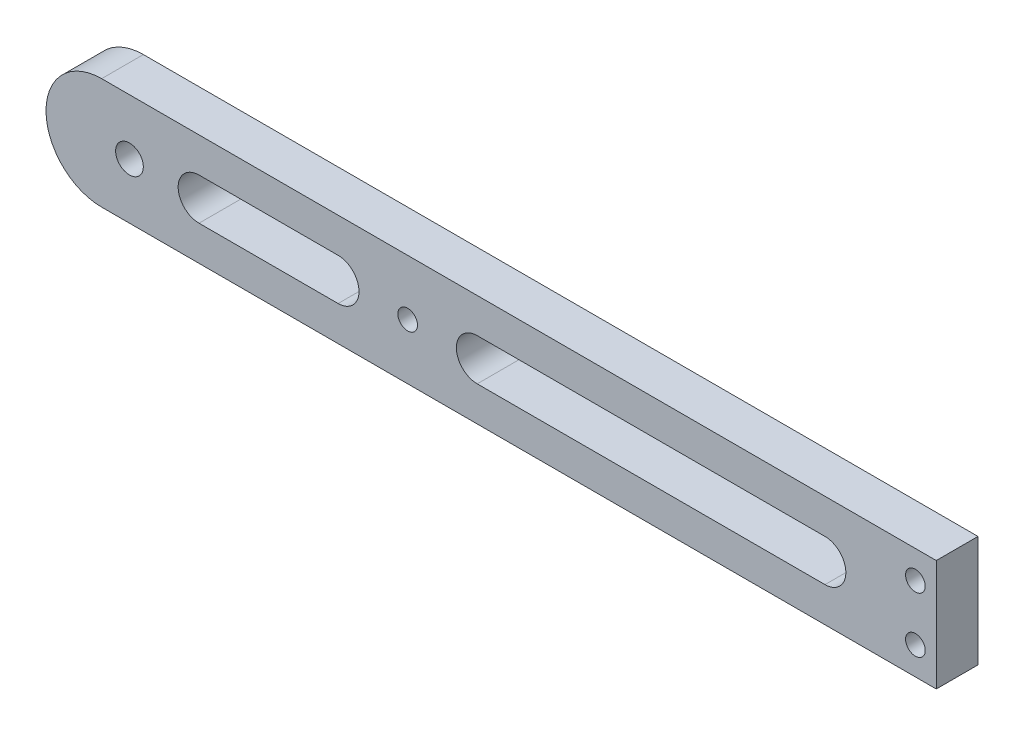
ISO-10303-21;
HEADER;
FILE_DESCRIPTION(('STEP AP214'),'2;1');
FILE_NAME('part.step','',(''),(''),'','','');
FILE_SCHEMA(('AUTOMOTIVE_DESIGN { 1 0 10303 214 1 1 1 1 }'));
ENDSEC;
DATA;
#1=APPLICATION_CONTEXT('core data for automotive mechanical design processes');
#2=APPLICATION_PROTOCOL_DEFINITION('international standard','automotive_design',2000,#1);
#3=PRODUCT_CONTEXT('',#1,'mechanical');
#4=PRODUCT('Part','Part','',(#3));
#5=PRODUCT_RELATED_PRODUCT_CATEGORY('part','',(#4));
#6=PRODUCT_DEFINITION_FORMATION('','',#4);
#7=PRODUCT_DEFINITION_CONTEXT('part definition',#1,'design');
#8=PRODUCT_DEFINITION('design','',#6,#7);
#9=PRODUCT_DEFINITION_SHAPE('','',#8);
#10=(LENGTH_UNIT() NAMED_UNIT(*) SI_UNIT(.MILLI.,.METRE.));
#11=(NAMED_UNIT(*) PLANE_ANGLE_UNIT() SI_UNIT($,.RADIAN.));
#12=(NAMED_UNIT(*) SI_UNIT($,.STERADIAN.) SOLID_ANGLE_UNIT());
#13=UNCERTAINTY_MEASURE_WITH_UNIT(LENGTH_MEASURE(1.E-05),#10,'distance_accuracy_value','');
#14=(GEOMETRIC_REPRESENTATION_CONTEXT(3) GLOBAL_UNCERTAINTY_ASSIGNED_CONTEXT((#13)) GLOBAL_UNIT_ASSIGNED_CONTEXT((#10,
#11,#12)) REPRESENTATION_CONTEXT('',''));
#15=CARTESIAN_POINT('',(0.,0.,0.));
#16=DIRECTION('',(0.,0.,1.));
#17=DIRECTION('',(1.,0.,0.));
#18=AXIS2_PLACEMENT_3D('',#15,#16,#17);
#19=CARTESIAN_POINT('',(0.,0.,9.525));
#20=DIRECTION('',(0.,0.,1.));
#21=DIRECTION('',(1.,0.,0.));
#22=AXIS2_PLACEMENT_3D('',#19,#20,#21);
#23=PLANE('',#22);
#24=CARTESIAN_POINT('',(-136.525,12.7,9.525));
#25=DIRECTION('',(0.,0.,-1.));
#26=DIRECTION('',(-1.,0.,0.));
#27=AXIS2_PLACEMENT_3D('',#24,#25,#26);
#28=CIRCLE('',#27,4.7625);
#29=CARTESIAN_POINT('',(-136.525,17.4625,9.525));
#30=VERTEX_POINT('',#29);
#31=CARTESIAN_POINT('',(-136.525,7.9375,9.525));
#32=VERTEX_POINT('',#31);
#33=EDGE_CURVE('E140',#30,#32,#28,.T.);
#34=ORIENTED_EDGE('',*,*,#33,.T.);
#35=DIRECTION('',(-1.,0.,0.));
#36=VECTOR('',#35,1.);
#37=CARTESIAN_POINT('',(-136.525,7.9375,9.525));
#38=LINE('',#37,#36);
#39=CARTESIAN_POINT('',(-168.275,7.9375,9.525));
#40=VERTEX_POINT('',#39);
#41=EDGE_CURVE('E149',#32,#40,#38,.T.);
#42=ORIENTED_EDGE('',*,*,#41,.T.);
#43=CARTESIAN_POINT('',(-168.275,12.7,9.525));
#44=DIRECTION('',(0.,0.,-1.));
#45=DIRECTION('',(-1.,0.,0.));
#46=AXIS2_PLACEMENT_3D('',#43,#44,#45);
#47=CIRCLE('',#46,4.7625);
#48=CARTESIAN_POINT('',(-168.275,17.4625,9.525));
#49=VERTEX_POINT('',#48);
#50=EDGE_CURVE('E64',#40,#49,#47,.T.);
#51=ORIENTED_EDGE('',*,*,#50,.T.);
#52=DIRECTION('',(1.,0.,0.));
#53=VECTOR('',#52,1.);
#54=CARTESIAN_POINT('',(-136.525,17.4625,9.525));
#55=LINE('',#54,#53);
#56=EDGE_CURVE('E146',#49,#30,#55,.T.);
#57=ORIENTED_EDGE('',*,*,#56,.T.);
#58=EDGE_LOOP('',(#34,#42,#51,#57));
#59=FACE_BOUND('',#58,.T.);
#60=CARTESIAN_POINT('',(-25.4,12.7,9.525));
#61=DIRECTION('',(0.,0.,-1.));
#62=DIRECTION('',(-1.,0.,0.));
#63=AXIS2_PLACEMENT_3D('',#60,#61,#62);
#64=CIRCLE('',#63,4.7625);
#65=CARTESIAN_POINT('',(-25.4,17.4625,9.525));
#66=VERTEX_POINT('',#65);
#67=CARTESIAN_POINT('',(-25.4,7.9375,9.525));
#68=VERTEX_POINT('',#67);
#69=EDGE_CURVE('E174',#66,#68,#64,.T.);
#70=ORIENTED_EDGE('',*,*,#69,.T.);
#71=DIRECTION('',(-1.,0.,0.));
#72=VECTOR('',#71,1.);
#73=CARTESIAN_POINT('',(-25.4,7.9375,9.525));
#74=LINE('',#73,#72);
#75=CARTESIAN_POINT('',(-104.775,7.9375,9.525));
#76=VERTEX_POINT('',#75);
#77=EDGE_CURVE('E177',#68,#76,#74,.T.);
#78=ORIENTED_EDGE('',*,*,#77,.T.);
#79=CARTESIAN_POINT('',(-104.775,12.7,9.525));
#80=DIRECTION('',(0.,0.,-1.));
#81=DIRECTION('',(-1.,0.,0.));
#82=AXIS2_PLACEMENT_3D('',#79,#80,#81);
#83=CIRCLE('',#82,4.7625);
#84=CARTESIAN_POINT('',(-104.775,17.4625,9.525));
#85=VERTEX_POINT('',#84);
#86=EDGE_CURVE('E181',#76,#85,#83,.T.);
#87=ORIENTED_EDGE('',*,*,#86,.T.);
#88=DIRECTION('',(1.,0.,0.));
#89=VECTOR('',#88,1.);
#90=CARTESIAN_POINT('',(-25.4,17.4625,9.525));
#91=LINE('',#90,#89);
#92=EDGE_CURVE('E184',#85,#66,#91,.T.);
#93=ORIENTED_EDGE('',*,*,#92,.T.);
#94=EDGE_LOOP('',(#70,#78,#87,#93));
#95=FACE_BOUND('',#94,.T.);
#96=CARTESIAN_POINT('',(-120.65,12.7,9.525));
#97=DIRECTION('',(0.,0.,1.));
#98=DIRECTION('',(1.,0.,0.));
#99=AXIS2_PLACEMENT_3D('',#96,#97,#98);
#100=CIRCLE('',#99,2.2479);
#101=CARTESIAN_POINT('',(-118.4021,12.7,9.525));
#102=VERTEX_POINT('',#101);
#103=EDGE_CURVE('E216',#102,#102,#100,.T.);
#104=ORIENTED_EDGE('',*,*,#103,.F.);
#105=EDGE_LOOP('',(#104));
#106=FACE_BOUND('',#105,.T.);
#107=CARTESIAN_POINT('',(-184.15,12.7,9.525));
#108=DIRECTION('',(0.,0.,1.));
#109=DIRECTION('',(1.,0.,0.));
#110=AXIS2_PLACEMENT_3D('',#107,#108,#109);
#111=CIRCLE('',#110,3.1623);
#112=CARTESIAN_POINT('',(-180.9877,12.7,9.525));
#113=VERTEX_POINT('',#112);
#114=EDGE_CURVE('E222',#113,#113,#111,.T.);
#115=ORIENTED_EDGE('',*,*,#114,.F.);
#116=EDGE_LOOP('',(#115));
#117=FACE_BOUND('',#116,.T.);
#118=CARTESIAN_POINT('',(-4.7625,6.34999999999999,9.525));
#119=DIRECTION('',(0.,0.,1.));
#120=DIRECTION('',(1.,0.,0.));
#121=AXIS2_PLACEMENT_3D('',#118,#119,#120);
#122=CIRCLE('',#121,2.24789999999999);
#123=CARTESIAN_POINT('',(-2.51460000000001,6.34999999999999,9.525));
#124=VERTEX_POINT('',#123);
#125=EDGE_CURVE('E226',#124,#124,#122,.T.);
#126=ORIENTED_EDGE('',*,*,#125,.F.);
#127=EDGE_LOOP('',(#126));
#128=FACE_BOUND('',#127,.T.);
#129=CARTESIAN_POINT('',(-4.7625,19.05,9.525));
#130=DIRECTION('',(0.,0.,1.));
#131=DIRECTION('',(1.,0.,0.));
#132=AXIS2_PLACEMENT_3D('',#129,#130,#131);
#133=CIRCLE('',#132,2.24789999999999);
#134=CARTESIAN_POINT('',(-2.51460000000001,19.05,9.525));
#135=VERTEX_POINT('',#134);
#136=EDGE_CURVE('E231',#135,#135,#133,.T.);
#137=ORIENTED_EDGE('',*,*,#136,.F.);
#138=EDGE_LOOP('',(#137));
#139=FACE_BOUND('',#138,.T.);
#140=CARTESIAN_POINT('',(-190.5,12.7,9.525));
#141=DIRECTION('',(0.,0.,1.));
#142=DIRECTION('',(1.,0.,0.));
#143=AXIS2_PLACEMENT_3D('',#140,#141,#142);
#144=CIRCLE('',#143,12.7);
#145=CARTESIAN_POINT('',(-190.5,0.,9.525));
#146=VERTEX_POINT('',#145);
#147=CARTESIAN_POINT('',(-190.5,25.4,9.525));
#148=VERTEX_POINT('',#147);
#149=EDGE_CURVE('E208',#146,#148,#144,.F.);
#150=ORIENTED_EDGE('',*,*,#149,.F.);
#151=DIRECTION('',(1.,0.,0.));
#152=VECTOR('',#151,1.);
#153=CARTESIAN_POINT('',(0.,0.,9.525));
#154=LINE('',#153,#152);
#155=CARTESIAN_POINT('',(0.,0.,9.525));
#156=VERTEX_POINT('',#155);
#157=EDGE_CURVE('E245',#146,#156,#154,.T.);
#158=ORIENTED_EDGE('',*,*,#157,.T.);
#159=DIRECTION('',(0.,1.,0.));
#160=VECTOR('',#159,1.);
#161=CARTESIAN_POINT('',(0.,0.,9.525));
#162=LINE('',#161,#160);
#163=CARTESIAN_POINT('',(0.,25.4,9.525));
#164=VERTEX_POINT('',#163);
#165=EDGE_CURVE('E238',#156,#164,#162,.T.);
#166=ORIENTED_EDGE('',*,*,#165,.T.);
#167=DIRECTION('',(-1.,0.,0.));
#168=VECTOR('',#167,1.);
#169=CARTESIAN_POINT('',(0.,25.4,9.525));
#170=LINE('',#169,#168);
#171=EDGE_CURVE('E241',#164,#148,#170,.T.);
#172=ORIENTED_EDGE('',*,*,#171,.T.);
#173=EDGE_LOOP('',(#150,#158,#166,#172));
#174=FACE_BOUND('',#173,.T.);
#175=ADVANCED_FACE('F48',(#59,#95,#106,#117,#128,#139,#174),#23,.T.);
#176=CARTESIAN_POINT('',(0.,0.,0.));
#177=DIRECTION('',(0.,0.,1.));
#178=DIRECTION('',(1.,0.,0.));
#179=AXIS2_PLACEMENT_3D('',#176,#177,#178);
#180=PLANE('',#179);
#181=DIRECTION('',(-1.,0.,0.));
#182=VECTOR('',#181,1.);
#183=CARTESIAN_POINT('',(-136.525,7.9375,0.));
#184=LINE('',#183,#182);
#185=CARTESIAN_POINT('',(-136.525,7.9375,0.));
#186=VERTEX_POINT('',#185);
#187=CARTESIAN_POINT('',(-168.275,7.9375,0.));
#188=VERTEX_POINT('',#187);
#189=EDGE_CURVE('E164',#186,#188,#184,.T.);
#190=ORIENTED_EDGE('',*,*,#189,.F.);
#191=CARTESIAN_POINT('',(-136.525,12.7,0.));
#192=DIRECTION('',(0.,0.,-1.));
#193=DIRECTION('',(-1.,0.,0.));
#194=AXIS2_PLACEMENT_3D('',#191,#192,#193);
#195=CIRCLE('',#194,4.7625);
#196=CARTESIAN_POINT('',(-136.525,17.4625,0.));
#197=VERTEX_POINT('',#196);
#198=EDGE_CURVE('E72',#197,#186,#195,.T.);
#199=ORIENTED_EDGE('',*,*,#198,.F.);
#200=DIRECTION('',(1.,0.,0.));
#201=VECTOR('',#200,1.);
#202=CARTESIAN_POINT('',(-136.525,17.4625,0.));
#203=LINE('',#202,#201);
#204=CARTESIAN_POINT('',(-168.275,17.4625,0.));
#205=VERTEX_POINT('',#204);
#206=EDGE_CURVE('E155',#205,#197,#203,.T.);
#207=ORIENTED_EDGE('',*,*,#206,.F.);
#208=CARTESIAN_POINT('',(-168.275,12.7,0.));
#209=DIRECTION('',(0.,0.,-1.));
#210=DIRECTION('',(-1.,0.,0.));
#211=AXIS2_PLACEMENT_3D('',#208,#209,#210);
#212=CIRCLE('',#211,4.7625);
#213=EDGE_CURVE('E158',#188,#205,#212,.T.);
#214=ORIENTED_EDGE('',*,*,#213,.F.);
#215=EDGE_LOOP('',(#190,#199,#207,#214));
#216=FACE_BOUND('',#215,.T.);
#217=DIRECTION('',(-1.,0.,0.));
#218=VECTOR('',#217,1.);
#219=CARTESIAN_POINT('',(-25.4,7.9375,0.));
#220=LINE('',#219,#218);
#221=CARTESIAN_POINT('',(-25.4,7.9375,0.));
#222=VERTEX_POINT('',#221);
#223=CARTESIAN_POINT('',(-104.775,7.9375,0.));
#224=VERTEX_POINT('',#223);
#225=EDGE_CURVE('E189',#222,#224,#220,.T.);
#226=ORIENTED_EDGE('',*,*,#225,.F.);
#227=CARTESIAN_POINT('',(-25.4,12.7,0.));
#228=DIRECTION('',(0.,0.,-1.));
#229=DIRECTION('',(-1.,0.,0.));
#230=AXIS2_PLACEMENT_3D('',#227,#228,#229);
#231=CIRCLE('',#230,4.7625);
#232=CARTESIAN_POINT('',(-25.4,17.4625,0.));
#233=VERTEX_POINT('',#232);
#234=EDGE_CURVE('E170',#233,#222,#231,.T.);
#235=ORIENTED_EDGE('',*,*,#234,.F.);
#236=DIRECTION('',(1.,0.,0.));
#237=VECTOR('',#236,1.);
#238=CARTESIAN_POINT('',(-25.4,17.4625,0.));
#239=LINE('',#238,#237);
#240=CARTESIAN_POINT('',(-104.775,17.4625,0.));
#241=VERTEX_POINT('',#240);
#242=EDGE_CURVE('E178',#241,#233,#239,.T.);
#243=ORIENTED_EDGE('',*,*,#242,.F.);
#244=CARTESIAN_POINT('',(-104.775,12.7,0.));
#245=DIRECTION('',(0.,0.,-1.));
#246=DIRECTION('',(-1.,0.,0.));
#247=AXIS2_PLACEMENT_3D('',#244,#245,#246);
#248=CIRCLE('',#247,4.7625);
#249=EDGE_CURVE('E192',#224,#241,#248,.T.);
#250=ORIENTED_EDGE('',*,*,#249,.F.);
#251=EDGE_LOOP('',(#226,#235,#243,#250));
#252=FACE_BOUND('',#251,.T.);
#253=CARTESIAN_POINT('',(-120.65,12.7,0.));
#254=DIRECTION('',(0.,0.,1.));
#255=DIRECTION('',(1.,0.,0.));
#256=AXIS2_PLACEMENT_3D('',#253,#254,#255);
#257=CIRCLE('',#256,2.2479);
#258=CARTESIAN_POINT('',(-118.4021,12.7,0.));
#259=VERTEX_POINT('',#258);
#260=EDGE_CURVE('E219',#259,#259,#257,.T.);
#261=ORIENTED_EDGE('',*,*,#260,.T.);
#262=EDGE_LOOP('',(#261));
#263=FACE_BOUND('',#262,.T.);
#264=CARTESIAN_POINT('',(-184.15,12.7,0.));
#265=DIRECTION('',(0.,0.,1.));
#266=DIRECTION('',(1.,0.,0.));
#267=AXIS2_PLACEMENT_3D('',#264,#265,#266);
#268=CIRCLE('',#267,3.1623);
#269=CARTESIAN_POINT('',(-180.9877,12.7,0.));
#270=VERTEX_POINT('',#269);
#271=EDGE_CURVE('E223',#270,#270,#268,.T.);
#272=ORIENTED_EDGE('',*,*,#271,.T.);
#273=EDGE_LOOP('',(#272));
#274=FACE_BOUND('',#273,.T.);
#275=CARTESIAN_POINT('',(-4.7625,6.34999999999999,0.));
#276=DIRECTION('',(0.,0.,1.));
#277=DIRECTION('',(1.,0.,0.));
#278=AXIS2_PLACEMENT_3D('',#275,#276,#277);
#279=CIRCLE('',#278,2.24789999999999);
#280=CARTESIAN_POINT('',(-2.51460000000001,6.34999999999999,0.));
#281=VERTEX_POINT('',#280);
#282=EDGE_CURVE('E52',#281,#281,#279,.T.);
#283=ORIENTED_EDGE('',*,*,#282,.T.);
#284=EDGE_LOOP('',(#283));
#285=FACE_BOUND('',#284,.T.);
#286=CARTESIAN_POINT('',(-4.7625,19.05,0.));
#287=DIRECTION('',(0.,0.,1.));
#288=DIRECTION('',(1.,0.,0.));
#289=AXIS2_PLACEMENT_3D('',#286,#287,#288);
#290=CIRCLE('',#289,2.24789999999999);
#291=CARTESIAN_POINT('',(-2.51460000000001,19.05,0.));
#292=VERTEX_POINT('',#291);
#293=EDGE_CURVE('E234',#292,#292,#290,.T.);
#294=ORIENTED_EDGE('',*,*,#293,.T.);
#295=EDGE_LOOP('',(#294));
#296=FACE_BOUND('',#295,.T.);
#297=DIRECTION('',(1.,0.,0.));
#298=VECTOR('',#297,1.);
#299=CARTESIAN_POINT('',(0.,0.,0.));
#300=LINE('',#299,#298);
#301=CARTESIAN_POINT('',(-190.5,0.,0.));
#302=VERTEX_POINT('',#301);
#303=CARTESIAN_POINT('',(0.,0.,0.));
#304=VERTEX_POINT('',#303);
#305=EDGE_CURVE('E242',#302,#304,#300,.T.);
#306=ORIENTED_EDGE('',*,*,#305,.F.);
#307=CARTESIAN_POINT('',(-190.5,12.7,0.));
#308=DIRECTION('',(0.,0.,1.));
#309=DIRECTION('',(1.,0.,0.));
#310=AXIS2_PLACEMENT_3D('',#307,#308,#309);
#311=CIRCLE('',#310,12.7);
#312=CARTESIAN_POINT('',(-190.5,25.4,0.));
#313=VERTEX_POINT('',#312);
#314=EDGE_CURVE('E209',#302,#313,#311,.F.);
#315=ORIENTED_EDGE('',*,*,#314,.T.);
#316=DIRECTION('',(-1.,0.,0.));
#317=VECTOR('',#316,1.);
#318=CARTESIAN_POINT('',(0.,25.4,0.));
#319=LINE('',#318,#317);
#320=CARTESIAN_POINT('',(0.,25.4,0.));
#321=VERTEX_POINT('',#320);
#322=EDGE_CURVE('E249',#321,#313,#319,.T.);
#323=ORIENTED_EDGE('',*,*,#322,.F.);
#324=DIRECTION('',(0.,1.,0.));
#325=VECTOR('',#324,1.);
#326=CARTESIAN_POINT('',(0.,0.,0.));
#327=LINE('',#326,#325);
#328=EDGE_CURVE('E237',#304,#321,#327,.T.);
#329=ORIENTED_EDGE('',*,*,#328,.F.);
#330=EDGE_LOOP('',(#306,#315,#323,#329));
#331=FACE_BOUND('',#330,.T.);
#332=ADVANCED_FACE('F263',(#216,#252,#263,#274,#285,#296,#331),#180,.F.);
#333=CARTESIAN_POINT('',(0.,25.4,9.525));
#334=DIRECTION('',(0.,-1.,0.));
#335=DIRECTION('',(1.,0.,0.));
#336=AXIS2_PLACEMENT_3D('',#333,#334,#335);
#337=PLANE('',#336);
#338=DIRECTION('',(0.,0.,1.));
#339=VECTOR('',#338,1.);
#340=CARTESIAN_POINT('',(-190.5,25.4,0.));
#341=LINE('',#340,#339);
#342=EDGE_CURVE('E212',#313,#148,#341,.T.);
#343=ORIENTED_EDGE('',*,*,#342,.T.);
#344=ORIENTED_EDGE('',*,*,#171,.F.);
#345=DIRECTION('',(0.,0.,-1.));
#346=VECTOR('',#345,1.);
#347=CARTESIAN_POINT('',(0.,25.4,9.525));
#348=LINE('',#347,#346);
#349=EDGE_CURVE('E13',#164,#321,#348,.T.);
#350=ORIENTED_EDGE('',*,*,#349,.T.);
#351=ORIENTED_EDGE('',*,*,#322,.T.);
#352=EDGE_LOOP('',(#343,#344,#350,#351));
#353=FACE_BOUND('',#352,.T.);
#354=ADVANCED_FACE('F265',(#353),#337,.F.);
#355=CARTESIAN_POINT('',(0.,0.,9.525));
#356=DIRECTION('',(-1.,0.,0.));
#357=DIRECTION('',(0.,0.,1.));
#358=AXIS2_PLACEMENT_3D('',#355,#356,#357);
#359=PLANE('',#358);
#360=ORIENTED_EDGE('',*,*,#328,.T.);
#361=ORIENTED_EDGE('',*,*,#349,.F.);
#362=ORIENTED_EDGE('',*,*,#165,.F.);
#363=DIRECTION('',(0.,0.,-1.));
#364=VECTOR('',#363,1.);
#365=CARTESIAN_POINT('',(0.,0.,9.525));
#366=LINE('',#365,#364);
#367=EDGE_CURVE('E57',#156,#304,#366,.T.);
#368=ORIENTED_EDGE('',*,*,#367,.T.);
#369=EDGE_LOOP('',(#360,#361,#362,#368));
#370=FACE_BOUND('',#369,.T.);
#371=ADVANCED_FACE('F50',(#370),#359,.F.);
#372=CARTESIAN_POINT('',(0.,0.,9.525));
#373=DIRECTION('',(0.,1.,0.));
#374=DIRECTION('',(-1.,0.,0.));
#375=AXIS2_PLACEMENT_3D('',#372,#373,#374);
#376=PLANE('',#375);
#377=ORIENTED_EDGE('',*,*,#157,.F.);
#378=DIRECTION('',(0.,0.,1.));
#379=VECTOR('',#378,1.);
#380=CARTESIAN_POINT('',(-190.5,0.,0.));
#381=LINE('',#380,#379);
#382=EDGE_CURVE('E199',#302,#146,#381,.T.);
#383=ORIENTED_EDGE('',*,*,#382,.F.);
#384=ORIENTED_EDGE('',*,*,#305,.T.);
#385=ORIENTED_EDGE('',*,*,#367,.F.);
#386=EDGE_LOOP('',(#377,#383,#384,#385));
#387=FACE_BOUND('',#386,.T.);
#388=ADVANCED_FACE('F268',(#387),#376,.F.);
#389=CARTESIAN_POINT('',(-4.7625,19.05,9.525));
#390=DIRECTION('',(0.,0.,1.));
#391=DIRECTION('',(1.,0.,0.));
#392=AXIS2_PLACEMENT_3D('',#389,#390,#391);
#393=CYLINDRICAL_SURFACE('',#392,2.24789999999999);
#394=ORIENTED_EDGE('',*,*,#136,.T.);
#395=EDGE_LOOP('',(#394));
#396=FACE_BOUND('',#395,.T.);
#397=ORIENTED_EDGE('',*,*,#293,.F.);
#398=EDGE_LOOP('',(#397));
#399=FACE_BOUND('',#398,.T.);
#400=ADVANCED_FACE('F293',(#396,#399),#393,.F.);
#401=CARTESIAN_POINT('',(-4.7625,6.34999999999999,9.525));
#402=DIRECTION('',(0.,0.,1.));
#403=DIRECTION('',(1.,0.,0.));
#404=AXIS2_PLACEMENT_3D('',#401,#402,#403);
#405=CYLINDRICAL_SURFACE('',#404,2.24789999999999);
#406=ORIENTED_EDGE('',*,*,#125,.T.);
#407=EDGE_LOOP('',(#406));
#408=FACE_BOUND('',#407,.T.);
#409=ORIENTED_EDGE('',*,*,#282,.F.);
#410=EDGE_LOOP('',(#409));
#411=FACE_BOUND('',#410,.T.);
#412=ADVANCED_FACE('F313',(#408,#411),#405,.F.);
#413=CARTESIAN_POINT('',(-184.15,12.7,0.));
#414=DIRECTION('',(0.,0.,1.));
#415=DIRECTION('',(1.,0.,0.));
#416=AXIS2_PLACEMENT_3D('',#413,#414,#415);
#417=CYLINDRICAL_SURFACE('',#416,3.1623);
#418=ORIENTED_EDGE('',*,*,#271,.F.);
#419=EDGE_LOOP('',(#418));
#420=FACE_BOUND('',#419,.T.);
#421=ORIENTED_EDGE('',*,*,#114,.T.);
#422=EDGE_LOOP('',(#421));
#423=FACE_BOUND('',#422,.T.);
#424=ADVANCED_FACE('F282',(#420,#423),#417,.F.);
#425=CARTESIAN_POINT('',(-120.65,12.7,9.525));
#426=DIRECTION('',(0.,0.,1.));
#427=DIRECTION('',(1.,0.,0.));
#428=AXIS2_PLACEMENT_3D('',#425,#426,#427);
#429=CYLINDRICAL_SURFACE('',#428,2.2479);
#430=ORIENTED_EDGE('',*,*,#103,.T.);
#431=EDGE_LOOP('',(#430));
#432=FACE_BOUND('',#431,.T.);
#433=ORIENTED_EDGE('',*,*,#260,.F.);
#434=EDGE_LOOP('',(#433));
#435=FACE_BOUND('',#434,.T.);
#436=ADVANCED_FACE('F273',(#432,#435),#429,.F.);
#437=CARTESIAN_POINT('',(-190.5,12.7,0.));
#438=DIRECTION('',(0.,0.,1.));
#439=DIRECTION('',(1.,0.,0.));
#440=AXIS2_PLACEMENT_3D('',#437,#438,#439);
#441=CYLINDRICAL_SURFACE('',#440,12.7);
#442=ORIENTED_EDGE('',*,*,#149,.T.);
#443=ORIENTED_EDGE('',*,*,#342,.F.);
#444=ORIENTED_EDGE('',*,*,#314,.F.);
#445=ORIENTED_EDGE('',*,*,#382,.T.);
#446=EDGE_LOOP('',(#442,#443,#444,#445));
#447=FACE_BOUND('',#446,.T.);
#448=ADVANCED_FACE('F270',(#447),#441,.T.);
#449=CARTESIAN_POINT('',(-25.4,12.7,9.525));
#450=DIRECTION('',(0.,0.,-1.));
#451=DIRECTION('',(-1.,0.,0.));
#452=AXIS2_PLACEMENT_3D('',#449,#450,#451);
#453=CYLINDRICAL_SURFACE('',#452,4.7625);
#454=ORIENTED_EDGE('',*,*,#234,.T.);
#455=DIRECTION('',(0.,0.,-1.));
#456=VECTOR('',#455,1.);
#457=CARTESIAN_POINT('',(-25.4,7.9375,9.525));
#458=LINE('',#457,#456);
#459=EDGE_CURVE('E187',#68,#222,#458,.T.);
#460=ORIENTED_EDGE('',*,*,#459,.F.);
#461=ORIENTED_EDGE('',*,*,#69,.F.);
#462=DIRECTION('',(0.,0.,-1.));
#463=VECTOR('',#462,1.);
#464=CARTESIAN_POINT('',(-25.4,17.4625,9.525));
#465=LINE('',#464,#463);
#466=EDGE_CURVE('E197',#66,#233,#465,.T.);
#467=ORIENTED_EDGE('',*,*,#466,.T.);
#468=EDGE_LOOP('',(#454,#460,#461,#467));
#469=FACE_BOUND('',#468,.T.);
#470=ADVANCED_FACE('F272',(#469),#453,.F.);
#471=CARTESIAN_POINT('',(-25.4,17.4625,9.525));
#472=DIRECTION('',(0.,1.,0.));
#473=DIRECTION('',(0.,0.,1.));
#474=AXIS2_PLACEMENT_3D('',#471,#472,#473);
#475=PLANE('',#474);
#476=ORIENTED_EDGE('',*,*,#242,.T.);
#477=ORIENTED_EDGE('',*,*,#466,.F.);
#478=ORIENTED_EDGE('',*,*,#92,.F.);
#479=DIRECTION('',(0.,0.,-1.));
#480=VECTOR('',#479,1.);
#481=CARTESIAN_POINT('',(-104.775,17.4625,9.525));
#482=LINE('',#481,#480);
#483=EDGE_CURVE('E200',#85,#241,#482,.T.);
#484=ORIENTED_EDGE('',*,*,#483,.T.);
#485=EDGE_LOOP('',(#476,#477,#478,#484));
#486=FACE_BOUND('',#485,.T.);
#487=ADVANCED_FACE('F279',(#486),#475,.F.);
#488=CARTESIAN_POINT('',(-104.775,12.7,9.525));
#489=DIRECTION('',(0.,0.,-1.));
#490=DIRECTION('',(-1.,0.,0.));
#491=AXIS2_PLACEMENT_3D('',#488,#489,#490);
#492=CYLINDRICAL_SURFACE('',#491,4.7625);
#493=ORIENTED_EDGE('',*,*,#249,.T.);
#494=ORIENTED_EDGE('',*,*,#483,.F.);
#495=ORIENTED_EDGE('',*,*,#86,.F.);
#496=DIRECTION('',(0.,0.,-1.));
#497=VECTOR('',#496,1.);
#498=CARTESIAN_POINT('',(-104.775,7.9375,9.525));
#499=LINE('',#498,#497);
#500=EDGE_CURVE('E202',#76,#224,#499,.T.);
#501=ORIENTED_EDGE('',*,*,#500,.T.);
#502=EDGE_LOOP('',(#493,#494,#495,#501));
#503=FACE_BOUND('',#502,.T.);
#504=ADVANCED_FACE('F366',(#503),#492,.F.);
#505=CARTESIAN_POINT('',(-25.4,7.9375,9.525));
#506=DIRECTION('',(0.,-1.,0.));
#507=DIRECTION('',(0.,0.,-1.));
#508=AXIS2_PLACEMENT_3D('',#505,#506,#507);
#509=PLANE('',#508);
#510=ORIENTED_EDGE('',*,*,#225,.T.);
#511=ORIENTED_EDGE('',*,*,#500,.F.);
#512=ORIENTED_EDGE('',*,*,#77,.F.);
#513=ORIENTED_EDGE('',*,*,#459,.T.);
#514=EDGE_LOOP('',(#510,#511,#512,#513));
#515=FACE_BOUND('',#514,.T.);
#516=ADVANCED_FACE('F375',(#515),#509,.F.);
#517=CARTESIAN_POINT('',(-136.525,12.7,9.525));
#518=DIRECTION('',(0.,0.,-1.));
#519=DIRECTION('',(-1.,0.,0.));
#520=AXIS2_PLACEMENT_3D('',#517,#518,#519);
#521=CYLINDRICAL_SURFACE('',#520,4.7625);
#522=ORIENTED_EDGE('',*,*,#198,.T.);
#523=DIRECTION('',(0.,0.,-1.));
#524=VECTOR('',#523,1.);
#525=CARTESIAN_POINT('',(-136.525,7.9375,9.525));
#526=LINE('',#525,#524);
#527=EDGE_CURVE('E136',#32,#186,#526,.T.);
#528=ORIENTED_EDGE('',*,*,#527,.F.);
#529=ORIENTED_EDGE('',*,*,#33,.F.);
#530=DIRECTION('',(0.,0.,-1.));
#531=VECTOR('',#530,1.);
#532=CARTESIAN_POINT('',(-136.525,17.4625,9.525));
#533=LINE('',#532,#531);
#534=EDGE_CURVE('E168',#30,#197,#533,.T.);
#535=ORIENTED_EDGE('',*,*,#534,.T.);
#536=EDGE_LOOP('',(#522,#528,#529,#535));
#537=FACE_BOUND('',#536,.T.);
#538=ADVANCED_FACE('F138',(#537),#521,.F.);
#539=CARTESIAN_POINT('',(-136.525,17.4625,9.525));
#540=DIRECTION('',(0.,1.,0.));
#541=DIRECTION('',(-1.,0.,0.));
#542=AXIS2_PLACEMENT_3D('',#539,#540,#541);
#543=PLANE('',#542);
#544=ORIENTED_EDGE('',*,*,#206,.T.);
#545=ORIENTED_EDGE('',*,*,#534,.F.);
#546=ORIENTED_EDGE('',*,*,#56,.F.);
#547=DIRECTION('',(0.,0.,-1.));
#548=VECTOR('',#547,1.);
#549=CARTESIAN_POINT('',(-168.275,17.4625,9.525));
#550=LINE('',#549,#548);
#551=EDGE_CURVE('E171',#49,#205,#550,.T.);
#552=ORIENTED_EDGE('',*,*,#551,.T.);
#553=EDGE_LOOP('',(#544,#545,#546,#552));
#554=FACE_BOUND('',#553,.T.);
#555=ADVANCED_FACE('F392',(#554),#543,.F.);
#556=CARTESIAN_POINT('',(-168.275,12.7,9.525));
#557=DIRECTION('',(0.,0.,-1.));
#558=DIRECTION('',(-1.,0.,0.));
#559=AXIS2_PLACEMENT_3D('',#556,#557,#558);
#560=CYLINDRICAL_SURFACE('',#559,4.7625);
#561=ORIENTED_EDGE('',*,*,#213,.T.);
#562=ORIENTED_EDGE('',*,*,#551,.F.);
#563=ORIENTED_EDGE('',*,*,#50,.F.);
#564=DIRECTION('',(0.,0.,-1.));
#565=VECTOR('',#564,1.);
#566=CARTESIAN_POINT('',(-168.275,7.9375,9.525));
#567=LINE('',#566,#565);
#568=EDGE_CURVE('E145',#40,#188,#567,.T.);
#569=ORIENTED_EDGE('',*,*,#568,.T.);
#570=EDGE_LOOP('',(#561,#562,#563,#569));
#571=FACE_BOUND('',#570,.T.);
#572=ADVANCED_FACE('F400',(#571),#560,.F.);
#573=CARTESIAN_POINT('',(-136.525,7.9375,9.525));
#574=DIRECTION('',(0.,-1.,0.));
#575=DIRECTION('',(1.,0.,0.));
#576=AXIS2_PLACEMENT_3D('',#573,#574,#575);
#577=PLANE('',#576);
#578=ORIENTED_EDGE('',*,*,#189,.T.);
#579=ORIENTED_EDGE('',*,*,#568,.F.);
#580=ORIENTED_EDGE('',*,*,#41,.F.);
#581=ORIENTED_EDGE('',*,*,#527,.T.);
#582=EDGE_LOOP('',(#578,#579,#580,#581));
#583=FACE_BOUND('',#582,.T.);
#584=ADVANCED_FACE('F150',(#583),#577,.F.);
#585=CLOSED_SHELL('',(#175,#332,#354,#371,#388,#400,#412,#424,#436,#448,#470,#487,#504,#516,
#538,#555,#572,#584));
#586=MANIFOLD_SOLID_BREP('B2',#585);
#587=ADVANCED_BREP_SHAPE_REPRESENTATION('',(#18,#586),#14);
#588=SHAPE_DEFINITION_REPRESENTATION(#9,#587);
ENDSEC;
END-ISO-10303-21;
